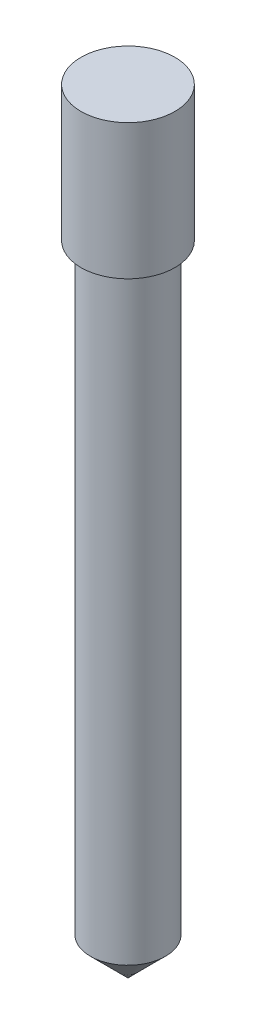
ISO-10303-21;
HEADER;
FILE_DESCRIPTION(('STEP AP214'),'2;1');
FILE_NAME('part.step','',(''),(''),'','','');
FILE_SCHEMA(('AUTOMOTIVE_DESIGN { 1 0 10303 214 1 1 1 1 }'));
ENDSEC;
DATA;
#1=APPLICATION_CONTEXT('core data for automotive mechanical design processes');
#2=APPLICATION_PROTOCOL_DEFINITION('international standard','automotive_design',2000,#1);
#3=PRODUCT_CONTEXT('',#1,'mechanical');
#4=PRODUCT('Part','Part','',(#3));
#5=PRODUCT_RELATED_PRODUCT_CATEGORY('part','',(#4));
#6=PRODUCT_DEFINITION_FORMATION('','',#4);
#7=PRODUCT_DEFINITION_CONTEXT('part definition',#1,'design');
#8=PRODUCT_DEFINITION('design','',#6,#7);
#9=PRODUCT_DEFINITION_SHAPE('','',#8);
#10=(LENGTH_UNIT() NAMED_UNIT(*) SI_UNIT(.MILLI.,.METRE.));
#11=(NAMED_UNIT(*) PLANE_ANGLE_UNIT() SI_UNIT($,.RADIAN.));
#12=(NAMED_UNIT(*) SI_UNIT($,.STERADIAN.) SOLID_ANGLE_UNIT());
#13=UNCERTAINTY_MEASURE_WITH_UNIT(LENGTH_MEASURE(1.E-05),#10,'distance_accuracy_value','');
#14=(GEOMETRIC_REPRESENTATION_CONTEXT(3) GLOBAL_UNCERTAINTY_ASSIGNED_CONTEXT((#13)) GLOBAL_UNIT_ASSIGNED_CONTEXT((#10,
#11,#12)) REPRESENTATION_CONTEXT('',''));
#15=CARTESIAN_POINT('',(0.,0.,0.));
#16=DIRECTION('',(0.,0.,1.));
#17=DIRECTION('',(1.,0.,0.));
#18=AXIS2_PLACEMENT_3D('',#15,#16,#17);
#19=CARTESIAN_POINT('',(0.,85.,0.));
#20=DIRECTION('',(0.,-1.,0.));
#21=DIRECTION('',(0.,0.,-1.));
#22=AXIS2_PLACEMENT_3D('',#19,#20,#21);
#23=CYLINDRICAL_SURFACE('',#22,5.);
#24=CARTESIAN_POINT('',(0.,5.00000000000002,0.));
#25=DIRECTION('',(0.,1.,0.));
#26=DIRECTION('',(0.,0.,1.));
#27=AXIS2_PLACEMENT_3D('',#24,#25,#26);
#28=CIRCLE('',#27,5.);
#29=CARTESIAN_POINT('',(0.,5.00000000000002,5.));
#30=VERTEX_POINT('',#29);
#31=EDGE_CURVE('E11',#30,#30,#28,.T.);
#32=ORIENTED_EDGE('',*,*,#31,.T.);
#33=EDGE_LOOP('',(#32));
#34=FACE_BOUND('',#33,.T.);
#35=CARTESIAN_POINT('',(0.,85.,0.));
#36=DIRECTION('',(0.,1.,0.));
#37=DIRECTION('',(0.,0.,1.));
#38=AXIS2_PLACEMENT_3D('',#35,#36,#37);
#39=CIRCLE('',#38,5.);
#40=CARTESIAN_POINT('',(0.,85.,5.));
#41=VERTEX_POINT('',#40);
#42=EDGE_CURVE('E54',#41,#41,#39,.T.);
#43=ORIENTED_EDGE('',*,*,#42,.F.);
#44=EDGE_LOOP('',(#43));
#45=FACE_BOUND('',#44,.T.);
#46=ADVANCED_FACE('F45',(#34,#45),#23,.T.);
#47=CARTESIAN_POINT('',(0.,5.00000000000002,0.));
#48=DIRECTION('',(0.,1.,0.));
#49=DIRECTION('',(0.,0.,1.));
#50=AXIS2_PLACEMENT_3D('',#47,#48,#49);
#51=CONICAL_SURFACE('',#50,5.00000000000003,0.785398163397449);
#52=CARTESIAN_POINT('',(0.,0.,0.));
#53=VERTEX_POINT('',#52);
#54=VERTEX_LOOP('',#53);
#55=FACE_BOUND('',#54,.T.);
#56=ORIENTED_EDGE('',*,*,#31,.F.);
#57=EDGE_LOOP('',(#56));
#58=FACE_BOUND('',#57,.T.);
#59=ADVANCED_FACE('F48',(#55,#58),#51,.T.);
#60=CARTESIAN_POINT('',(0.,103.,0.));
#61=DIRECTION('',(0.,-1.,0.));
#62=DIRECTION('',(0.,0.,-1.));
#63=AXIS2_PLACEMENT_3D('',#60,#61,#62);
#64=CYLINDRICAL_SURFACE('',#63,6.25);
#65=CARTESIAN_POINT('',(0.,103.,0.));
#66=DIRECTION('',(0.,1.,0.));
#67=DIRECTION('',(0.,0.,1.));
#68=AXIS2_PLACEMENT_3D('',#65,#66,#67);
#69=CIRCLE('',#68,6.25);
#70=CARTESIAN_POINT('',(0.,103.,6.25));
#71=VERTEX_POINT('',#70);
#72=EDGE_CURVE('E68',#71,#71,#69,.T.);
#73=ORIENTED_EDGE('',*,*,#72,.F.);
#74=EDGE_LOOP('',(#73));
#75=FACE_BOUND('',#74,.T.);
#76=CARTESIAN_POINT('',(0.,85.,0.));
#77=DIRECTION('',(0.,1.,0.));
#78=DIRECTION('',(0.,0.,1.));
#79=AXIS2_PLACEMENT_3D('',#76,#77,#78);
#80=CIRCLE('',#79,6.25);
#81=CARTESIAN_POINT('',(0.,85.,6.25));
#82=VERTEX_POINT('',#81);
#83=EDGE_CURVE('E71',#82,#82,#80,.T.);
#84=ORIENTED_EDGE('',*,*,#83,.T.);
#85=EDGE_LOOP('',(#84));
#86=FACE_BOUND('',#85,.T.);
#87=ADVANCED_FACE('F59',(#75,#86),#64,.T.);
#88=CARTESIAN_POINT('',(0.,103.,0.));
#89=DIRECTION('',(0.,1.,0.));
#90=DIRECTION('',(0.,0.,1.));
#91=AXIS2_PLACEMENT_3D('',#88,#89,#90);
#92=PLANE('',#91);
#93=ORIENTED_EDGE('',*,*,#72,.T.);
#94=EDGE_LOOP('',(#93));
#95=FACE_BOUND('',#94,.T.);
#96=ADVANCED_FACE('F81',(#95),#92,.T.);
#97=CARTESIAN_POINT('',(0.,85.,0.));
#98=DIRECTION('',(0.,1.,0.));
#99=DIRECTION('',(0.,0.,1.));
#100=AXIS2_PLACEMENT_3D('',#97,#98,#99);
#101=PLANE('',#100);
#102=ORIENTED_EDGE('',*,*,#42,.T.);
#103=EDGE_LOOP('',(#102));
#104=FACE_BOUND('',#103,.T.);
#105=ORIENTED_EDGE('',*,*,#83,.F.);
#106=EDGE_LOOP('',(#105));
#107=FACE_BOUND('',#106,.T.);
#108=ADVANCED_FACE('F79',(#104,#107),#101,.F.);
#109=CLOSED_SHELL('',(#46,#59,#87,#96,#108));
#110=MANIFOLD_SOLID_BREP('B2',#109);
#111=ADVANCED_BREP_SHAPE_REPRESENTATION('',(#18,#110),#14);
#112=SHAPE_DEFINITION_REPRESENTATION(#9,#111);
ENDSEC;
END-ISO-10303-21;
